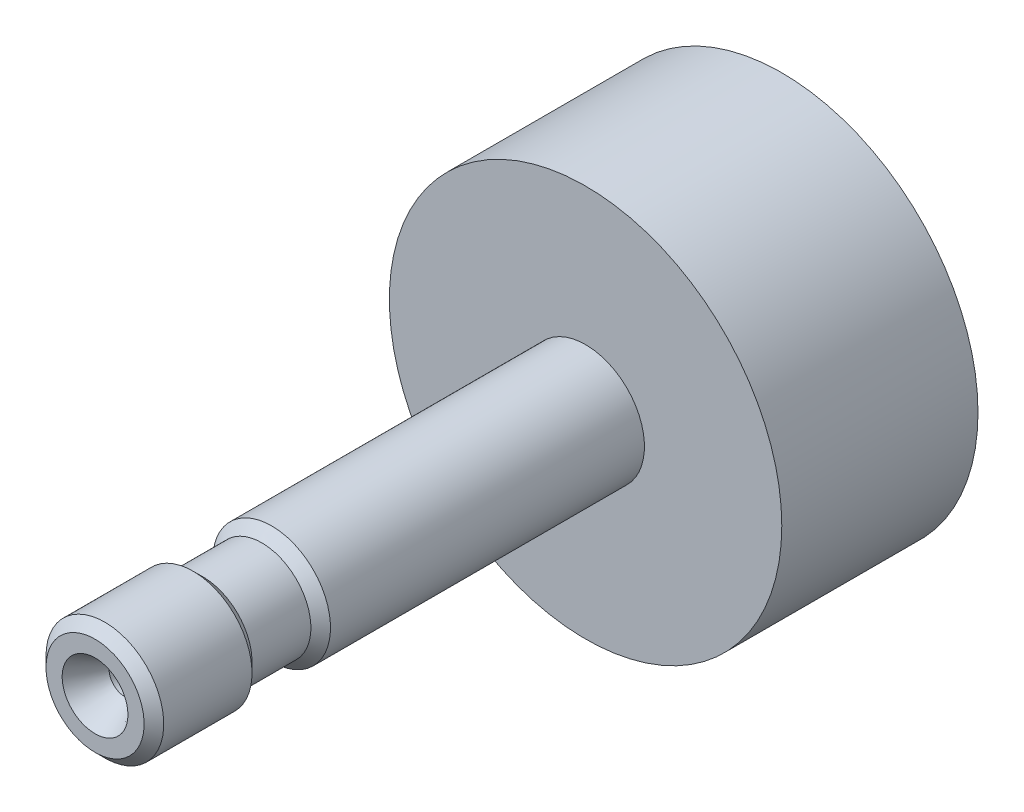
ISO-10303-21;
HEADER;
FILE_DESCRIPTION(('STEP AP214'),'2;1');
FILE_NAME('part.step','',(''),(''),'','','');
FILE_SCHEMA(('AUTOMOTIVE_DESIGN { 1 0 10303 214 1 1 1 1 }'));
ENDSEC;
DATA;
#1=APPLICATION_CONTEXT('core data for automotive mechanical design processes');
#2=APPLICATION_PROTOCOL_DEFINITION('international standard','automotive_design',2000,#1);
#3=PRODUCT_CONTEXT('',#1,'mechanical');
#4=PRODUCT('Part','Part','',(#3));
#5=PRODUCT_RELATED_PRODUCT_CATEGORY('part','',(#4));
#6=PRODUCT_DEFINITION_FORMATION('','',#4);
#7=PRODUCT_DEFINITION_CONTEXT('part definition',#1,'design');
#8=PRODUCT_DEFINITION('design','',#6,#7);
#9=PRODUCT_DEFINITION_SHAPE('','',#8);
#10=(LENGTH_UNIT() NAMED_UNIT(*) SI_UNIT(.MILLI.,.METRE.));
#11=(NAMED_UNIT(*) PLANE_ANGLE_UNIT() SI_UNIT($,.RADIAN.));
#12=(NAMED_UNIT(*) SI_UNIT($,.STERADIAN.) SOLID_ANGLE_UNIT());
#13=UNCERTAINTY_MEASURE_WITH_UNIT(LENGTH_MEASURE(1.E-05),#10,'distance_accuracy_value','');
#14=(GEOMETRIC_REPRESENTATION_CONTEXT(3) GLOBAL_UNCERTAINTY_ASSIGNED_CONTEXT((#13)) GLOBAL_UNIT_ASSIGNED_CONTEXT((#10,
#11,#12)) REPRESENTATION_CONTEXT('',''));
#15=CARTESIAN_POINT('',(0.,0.,0.));
#16=DIRECTION('',(0.,0.,1.));
#17=DIRECTION('',(1.,0.,0.));
#18=AXIS2_PLACEMENT_3D('',#15,#16,#17);
#19=CARTESIAN_POINT('',(0.,2.49999999999999,25.));
#20=DIRECTION('',(0.,0.,1.));
#21=DIRECTION('',(1.,0.,0.));
#22=AXIS2_PLACEMENT_3D('',#19,#20,#21);
#23=PLANE('',#22);
#24=CARTESIAN_POINT('',(0.,0.,25.));
#25=DIRECTION('',(0.,0.,-1.));
#26=DIRECTION('',(-1.,0.,0.));
#27=AXIS2_PLACEMENT_3D('',#24,#25,#26);
#28=CIRCLE('',#27,2.49999999999999);
#29=CARTESIAN_POINT('',(-2.49999999999999,0.,25.));
#30=VERTEX_POINT('',#29);
#31=EDGE_CURVE('E122',#30,#30,#28,.T.);
#32=ORIENTED_EDGE('',*,*,#31,.F.);
#33=EDGE_LOOP('',(#32));
#34=FACE_BOUND('',#33,.T.);
#35=CARTESIAN_POINT('',(0.,0.,25.));
#36=DIRECTION('',(0.,0.,1.));
#37=DIRECTION('',(1.,0.,0.));
#38=AXIS2_PLACEMENT_3D('',#35,#36,#37);
#39=CIRCLE('',#38,1.675);
#40=CARTESIAN_POINT('',(1.675,0.,25.));
#41=VERTEX_POINT('',#40);
#42=EDGE_CURVE('E128',#41,#41,#39,.T.);
#43=ORIENTED_EDGE('',*,*,#42,.F.);
#44=EDGE_LOOP('',(#43));
#45=FACE_BOUND('',#44,.T.);
#46=ADVANCED_FACE('F47',(#34,#45),#23,.T.);
#47=CARTESIAN_POINT('',(0.,0.,0.));
#48=DIRECTION('',(0.,0.,-1.));
#49=DIRECTION('',(-1.,0.,0.));
#50=AXIS2_PLACEMENT_3D('',#47,#48,#49);
#51=PLANE('',#50);
#52=CARTESIAN_POINT('',(0.,0.,0.));
#53=DIRECTION('',(0.,0.,-1.));
#54=DIRECTION('',(-1.,0.,0.));
#55=AXIS2_PLACEMENT_3D('',#52,#53,#54);
#56=CIRCLE('',#55,3.);
#57=CARTESIAN_POINT('',(-3.,0.,0.));
#58=VERTEX_POINT('',#57);
#59=EDGE_CURVE('E12',#58,#58,#56,.T.);
#60=ORIENTED_EDGE('',*,*,#59,.T.);
#61=EDGE_LOOP('',(#60));
#62=FACE_BOUND('',#61,.T.);
#63=ADVANCED_FACE('F49',(#62),#51,.T.);
#64=CARTESIAN_POINT('',(0.,0.,-0.937789373372546));
#65=DIRECTION('',(0.,0.,-1.));
#66=DIRECTION('',(-1.,0.,0.));
#67=AXIS2_PLACEMENT_3D('',#64,#65,#66);
#68=CYLINDRICAL_SURFACE('',#67,3.);
#69=CARTESIAN_POINT('',(0.,0.,16.));
#70=DIRECTION('',(0.,0.,-1.));
#71=DIRECTION('',(-1.,0.,0.));
#72=AXIS2_PLACEMENT_3D('',#69,#70,#71);
#73=CIRCLE('',#72,3.);
#74=CARTESIAN_POINT('',(-3.,0.,16.));
#75=VERTEX_POINT('',#74);
#76=EDGE_CURVE('E54',#75,#75,#73,.T.);
#77=ORIENTED_EDGE('',*,*,#76,.T.);
#78=EDGE_LOOP('',(#77));
#79=FACE_BOUND('',#78,.T.);
#80=ORIENTED_EDGE('',*,*,#59,.F.);
#81=EDGE_LOOP('',(#80));
#82=FACE_BOUND('',#81,.T.);
#83=ADVANCED_FACE('F75',(#79,#82),#68,.T.);
#84=CARTESIAN_POINT('',(0.,0.,16.));
#85=DIRECTION('',(0.,0.,-1.));
#86=DIRECTION('',(-1.,0.,0.));
#87=AXIS2_PLACEMENT_3D('',#84,#85,#86);
#88=CONICAL_SURFACE('',#87,3.,0.78539816339745);
#89=CARTESIAN_POINT('',(0.,0.,16.5));
#90=DIRECTION('',(0.,0.,-1.));
#91=DIRECTION('',(-1.,0.,0.));
#92=AXIS2_PLACEMENT_3D('',#89,#90,#91);
#93=CIRCLE('',#92,2.5);
#94=CARTESIAN_POINT('',(-2.5,0.,16.5));
#95=VERTEX_POINT('',#94);
#96=EDGE_CURVE('E109',#95,#95,#93,.T.);
#97=ORIENTED_EDGE('',*,*,#96,.T.);
#98=EDGE_LOOP('',(#97));
#99=FACE_BOUND('',#98,.T.);
#100=ORIENTED_EDGE('',*,*,#76,.F.);
#101=EDGE_LOOP('',(#100));
#102=FACE_BOUND('',#101,.T.);
#103=ADVANCED_FACE('F96',(#99,#102),#88,.T.);
#104=CARTESIAN_POINT('',(0.,0.,-0.937789373372546));
#105=DIRECTION('',(0.,0.,-1.));
#106=DIRECTION('',(-1.,0.,0.));
#107=AXIS2_PLACEMENT_3D('',#104,#105,#106);
#108=CYLINDRICAL_SURFACE('',#107,2.5);
#109=CARTESIAN_POINT('',(0.,0.,19.5));
#110=DIRECTION('',(0.,0.,-1.));
#111=DIRECTION('',(-1.,0.,0.));
#112=AXIS2_PLACEMENT_3D('',#109,#110,#111);
#113=CIRCLE('',#112,2.5);
#114=CARTESIAN_POINT('',(-2.5,0.,19.5));
#115=VERTEX_POINT('',#114);
#116=EDGE_CURVE('E111',#115,#115,#113,.T.);
#117=ORIENTED_EDGE('',*,*,#116,.T.);
#118=EDGE_LOOP('',(#117));
#119=FACE_BOUND('',#118,.T.);
#120=ORIENTED_EDGE('',*,*,#96,.F.);
#121=EDGE_LOOP('',(#120));
#122=FACE_BOUND('',#121,.T.);
#123=ADVANCED_FACE('F92',(#119,#122),#108,.T.);
#124=CARTESIAN_POINT('',(0.,0.,19.5));
#125=DIRECTION('',(0.,0.,1.));
#126=DIRECTION('',(1.,0.,0.));
#127=AXIS2_PLACEMENT_3D('',#124,#125,#126);
#128=CONICAL_SURFACE('',#127,2.5,0.785398163397446);
#129=CARTESIAN_POINT('',(0.,0.,20.));
#130=DIRECTION('',(0.,0.,-1.));
#131=DIRECTION('',(-1.,0.,0.));
#132=AXIS2_PLACEMENT_3D('',#129,#130,#131);
#133=CIRCLE('',#132,3.);
#134=CARTESIAN_POINT('',(-3.,0.,20.));
#135=VERTEX_POINT('',#134);
#136=EDGE_CURVE('E116',#135,#135,#133,.T.);
#137=ORIENTED_EDGE('',*,*,#136,.T.);
#138=EDGE_LOOP('',(#137));
#139=FACE_BOUND('',#138,.T.);
#140=ORIENTED_EDGE('',*,*,#116,.F.);
#141=EDGE_LOOP('',(#140));
#142=FACE_BOUND('',#141,.T.);
#143=ADVANCED_FACE('F88',(#139,#142),#128,.T.);
#144=CARTESIAN_POINT('',(0.,0.,-0.937789373372546));
#145=DIRECTION('',(0.,0.,-1.));
#146=DIRECTION('',(-1.,0.,0.));
#147=AXIS2_PLACEMENT_3D('',#144,#145,#146);
#148=CYLINDRICAL_SURFACE('',#147,3.);
#149=CARTESIAN_POINT('',(0.,0.,24.5));
#150=DIRECTION('',(0.,0.,-1.));
#151=DIRECTION('',(-1.,0.,0.));
#152=AXIS2_PLACEMENT_3D('',#149,#150,#151);
#153=CIRCLE('',#152,3.);
#154=CARTESIAN_POINT('',(-3.,0.,24.5));
#155=VERTEX_POINT('',#154);
#156=EDGE_CURVE('E119',#155,#155,#153,.T.);
#157=ORIENTED_EDGE('',*,*,#156,.T.);
#158=EDGE_LOOP('',(#157));
#159=FACE_BOUND('',#158,.T.);
#160=ORIENTED_EDGE('',*,*,#136,.F.);
#161=EDGE_LOOP('',(#160));
#162=FACE_BOUND('',#161,.T.);
#163=ADVANCED_FACE('F84',(#159,#162),#148,.T.);
#164=CARTESIAN_POINT('',(0.,0.,24.5));
#165=DIRECTION('',(0.,0.,-1.));
#166=DIRECTION('',(-1.,0.,0.));
#167=AXIS2_PLACEMENT_3D('',#164,#165,#166);
#168=CONICAL_SURFACE('',#167,3.,0.78539816339745);
#169=ORIENTED_EDGE('',*,*,#31,.T.);
#170=EDGE_LOOP('',(#169));
#171=FACE_BOUND('',#170,.T.);
#172=ORIENTED_EDGE('',*,*,#156,.F.);
#173=EDGE_LOOP('',(#172));
#174=FACE_BOUND('',#173,.T.);
#175=ADVANCED_FACE('F81',(#171,#174),#168,.T.);
#176=CARTESIAN_POINT('',(0.,0.,25.));
#177=DIRECTION('',(0.,0.,1.));
#178=DIRECTION('',(1.,0.,0.));
#179=AXIS2_PLACEMENT_3D('',#176,#177,#178);
#180=CYLINDRICAL_SURFACE('',#179,0.8);
#181=CARTESIAN_POINT('',(0.,0.,23.4844555433772));
#182=DIRECTION('',(0.,0.,1.));
#183=DIRECTION('',(1.,0.,0.));
#184=AXIS2_PLACEMENT_3D('',#181,#182,#183);
#185=CIRCLE('',#184,0.8);
#186=CARTESIAN_POINT('',(0.8,0.,23.4844555433772));
#187=VERTEX_POINT('',#186);
#188=EDGE_CURVE('E125',#187,#187,#185,.T.);
#189=ORIENTED_EDGE('',*,*,#188,.T.);
#190=EDGE_LOOP('',(#189));
#191=FACE_BOUND('',#190,.T.);
#192=CARTESIAN_POINT('',(0.,0.,22.1));
#193=DIRECTION('',(0.,0.,1.));
#194=DIRECTION('',(1.,0.,0.));
#195=AXIS2_PLACEMENT_3D('',#192,#193,#194);
#196=CIRCLE('',#195,0.8);
#197=CARTESIAN_POINT('',(0.8,0.,22.1));
#198=VERTEX_POINT('',#197);
#199=EDGE_CURVE('E131',#198,#198,#196,.T.);
#200=ORIENTED_EDGE('',*,*,#199,.F.);
#201=EDGE_LOOP('',(#200));
#202=FACE_BOUND('',#201,.T.);
#203=ADVANCED_FACE('F65',(#191,#202),#180,.F.);
#204=CARTESIAN_POINT('',(0.,0.,23.4844555433772));
#205=DIRECTION('',(0.,0.,1.));
#206=DIRECTION('',(1.,0.,0.));
#207=AXIS2_PLACEMENT_3D('',#204,#205,#206);
#208=CONICAL_SURFACE('',#207,0.8,0.523598775598293);
#209=ORIENTED_EDGE('',*,*,#42,.T.);
#210=EDGE_LOOP('',(#209));
#211=FACE_BOUND('',#210,.T.);
#212=ORIENTED_EDGE('',*,*,#188,.F.);
#213=EDGE_LOOP('',(#212));
#214=FACE_BOUND('',#213,.T.);
#215=ADVANCED_FACE('F59',(#211,#214),#208,.F.);
#216=CARTESIAN_POINT('',(0.,0.,21.6193115047779));
#217=DIRECTION('',(0.,0.,1.));
#218=DIRECTION('',(1.,0.,0.));
#219=AXIS2_PLACEMENT_3D('',#216,#217,#218);
#220=CONICAL_SURFACE('',#219,0.,1.02974425867665);
#221=ORIENTED_EDGE('',*,*,#199,.T.);
#222=EDGE_LOOP('',(#221));
#223=FACE_BOUND('',#222,.T.);
#224=CARTESIAN_POINT('',(0.,0.,21.6193115047779));
#225=VERTEX_POINT('',#224);
#226=VERTEX_LOOP('',#225);
#227=FACE_BOUND('',#226,.T.);
#228=ADVANCED_FACE('F57',(#223,#227),#220,.F.);
#229=CLOSED_SHELL('',(#46,#63,#83,#103,#123,#143,#163,#175,#203,#215,#228));
#230=MANIFOLD_SOLID_BREP('B2',#229);
#231=CARTESIAN_POINT('',(0.,0.,-10.));
#232=DIRECTION('',(0.,0.,1.));
#233=DIRECTION('',(1.,0.,0.));
#234=AXIS2_PLACEMENT_3D('',#231,#232,#233);
#235=CYLINDRICAL_SURFACE('',#234,10.);
#236=CARTESIAN_POINT('',(0.,0.,-10.));
#237=DIRECTION('',(0.,0.,1.));
#238=DIRECTION('',(1.,0.,0.));
#239=AXIS2_PLACEMENT_3D('',#236,#237,#238);
#240=CIRCLE('',#239,10.);
#241=CARTESIAN_POINT('',(10.,0.,-10.));
#242=VERTEX_POINT('',#241);
#243=EDGE_CURVE('E46',#242,#242,#240,.T.);
#244=ORIENTED_EDGE('',*,*,#243,.T.);
#245=EDGE_LOOP('',(#244));
#246=FACE_BOUND('',#245,.T.);
#247=CARTESIAN_POINT('',(0.,0.,0.));
#248=DIRECTION('',(0.,0.,1.));
#249=DIRECTION('',(1.,0.,0.));
#250=AXIS2_PLACEMENT_3D('',#247,#248,#249);
#251=CIRCLE('',#250,10.);
#252=CARTESIAN_POINT('',(10.,0.,0.));
#253=VERTEX_POINT('',#252);
#254=EDGE_CURVE('E218',#253,#253,#251,.T.);
#255=ORIENTED_EDGE('',*,*,#254,.F.);
#256=EDGE_LOOP('',(#255));
#257=FACE_BOUND('',#256,.T.);
#258=ADVANCED_FACE('F215',(#246,#257),#235,.T.);
#259=CARTESIAN_POINT('',(0.,0.,-10.));
#260=DIRECTION('',(0.,0.,1.));
#261=DIRECTION('',(1.,0.,0.));
#262=AXIS2_PLACEMENT_3D('',#259,#260,#261);
#263=PLANE('',#262);
#264=ORIENTED_EDGE('',*,*,#243,.F.);
#265=EDGE_LOOP('',(#264));
#266=FACE_BOUND('',#265,.T.);
#267=ADVANCED_FACE('F230',(#266),#263,.F.);
#268=CARTESIAN_POINT('',(0.,0.,0.));
#269=DIRECTION('',(0.,0.,1.));
#270=DIRECTION('',(1.,0.,0.));
#271=AXIS2_PLACEMENT_3D('',#268,#269,#270);
#272=PLANE('',#271);
#273=ORIENTED_EDGE('',*,*,#254,.T.);
#274=EDGE_LOOP('',(#273));
#275=FACE_BOUND('',#274,.T.);
#276=ADVANCED_FACE('F227',(#275),#272,.T.);
#277=CLOSED_SHELL('',(#258,#267,#276));
#278=MANIFOLD_SOLID_BREP('B6',#277);
#279=ADVANCED_BREP_SHAPE_REPRESENTATION('',(#18,#230,#278),#14);
#280=SHAPE_DEFINITION_REPRESENTATION(#9,#279);
ENDSEC;
END-ISO-10303-21;
